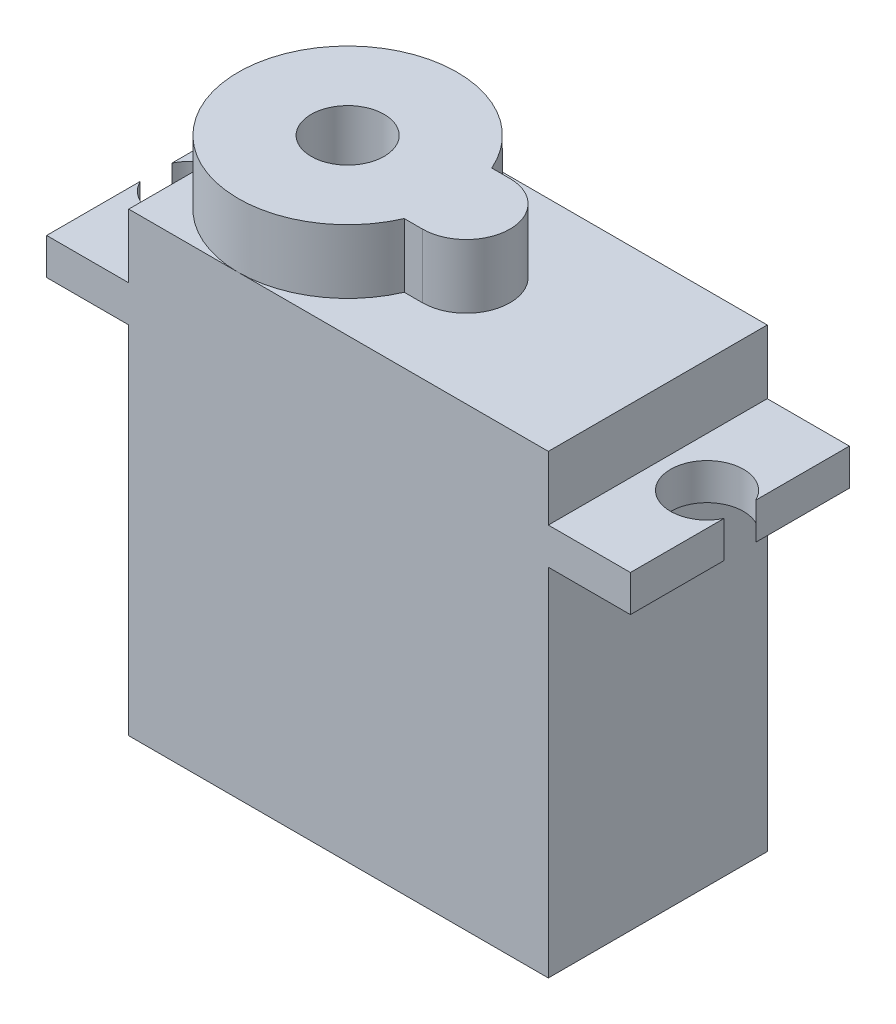
ISO-10303-21;
HEADER;
FILE_DESCRIPTION(('STEP AP214'),'2;1');
FILE_NAME('part.step','',(''),(''),'','','');
FILE_SCHEMA(('AUTOMOTIVE_DESIGN { 1 0 10303 214 1 1 1 1 }'));
ENDSEC;
DATA;
#1=APPLICATION_CONTEXT('core data for automotive mechanical design processes');
#2=APPLICATION_PROTOCOL_DEFINITION('international standard','automotive_design',2000,#1);
#3=PRODUCT_CONTEXT('',#1,'mechanical');
#4=PRODUCT('Part','Part','',(#3));
#5=PRODUCT_RELATED_PRODUCT_CATEGORY('part','',(#4));
#6=PRODUCT_DEFINITION_FORMATION('','',#4);
#7=PRODUCT_DEFINITION_CONTEXT('part definition',#1,'design');
#8=PRODUCT_DEFINITION('design','',#6,#7);
#9=PRODUCT_DEFINITION_SHAPE('','',#8);
#10=(LENGTH_UNIT() NAMED_UNIT(*) SI_UNIT(.MILLI.,.METRE.));
#11=(NAMED_UNIT(*) PLANE_ANGLE_UNIT() SI_UNIT($,.RADIAN.));
#12=(NAMED_UNIT(*) SI_UNIT($,.STERADIAN.) SOLID_ANGLE_UNIT());
#13=UNCERTAINTY_MEASURE_WITH_UNIT(LENGTH_MEASURE(1.E-05),#10,'distance_accuracy_value','');
#14=(GEOMETRIC_REPRESENTATION_CONTEXT(3) GLOBAL_UNCERTAINTY_ASSIGNED_CONTEXT((#13)) GLOBAL_UNIT_ASSIGNED_CONTEXT((#10,
#11,#12)) REPRESENTATION_CONTEXT('',''));
#15=CARTESIAN_POINT('',(0.,0.,0.));
#16=DIRECTION('',(0.,0.,1.));
#17=DIRECTION('',(1.,0.,0.));
#18=AXIS2_PLACEMENT_3D('',#15,#16,#17);
#19=CARTESIAN_POINT('',(0.,25.,0.));
#20=DIRECTION('',(0.,1.,0.));
#21=DIRECTION('',(0.,0.,1.));
#22=AXIS2_PLACEMENT_3D('',#19,#20,#21);
#23=PLANE('',#22);
#24=CARTESIAN_POINT('',(-5.5,25.,0.));
#25=DIRECTION('',(0.,1.,0.));
#26=DIRECTION('',(0.,0.,1.));
#27=AXIS2_PLACEMENT_3D('',#24,#25,#26);
#28=CIRCLE('',#27,6.);
#29=CARTESIAN_POINT('',(0.,25.,-2.39791576165636));
#30=VERTEX_POINT('',#29);
#31=CARTESIAN_POINT('',(-5.5,25.,-6.));
#32=VERTEX_POINT('',#31);
#33=EDGE_CURVE('E230',#30,#32,#28,.T.);
#34=ORIENTED_EDGE('',*,*,#33,.F.);
#35=DIRECTION('',(-1.,0.,0.));
#36=VECTOR('',#35,1.);
#37=CARTESIAN_POINT('',(0.,25.,-2.39791576165636));
#38=LINE('',#37,#36);
#39=CARTESIAN_POINT('',(1.,25.,-2.39791576165636));
#40=VERTEX_POINT('',#39);
#41=EDGE_CURVE('E212',#40,#30,#38,.T.);
#42=ORIENTED_EDGE('',*,*,#41,.F.);
#43=CARTESIAN_POINT('',(1.,25.,0.));
#44=DIRECTION('',(0.,1.,0.));
#45=DIRECTION('',(0.,0.,1.));
#46=AXIS2_PLACEMENT_3D('',#43,#44,#45);
#47=CIRCLE('',#46,2.39791576165636);
#48=CARTESIAN_POINT('',(1.,25.,2.39791576165636));
#49=VERTEX_POINT('',#48);
#50=EDGE_CURVE('E235',#49,#40,#47,.T.);
#51=ORIENTED_EDGE('',*,*,#50,.F.);
#52=DIRECTION('',(-1.,0.,0.));
#53=VECTOR('',#52,1.);
#54=CARTESIAN_POINT('',(0.,25.,2.39791576165636));
#55=LINE('',#54,#53);
#56=CARTESIAN_POINT('',(0.,25.,2.39791576165636));
#57=VERTEX_POINT('',#56);
#58=EDGE_CURVE('E232',#49,#57,#55,.T.);
#59=ORIENTED_EDGE('',*,*,#58,.T.);
#60=CARTESIAN_POINT('',(-5.5,25.,6.));
#61=VERTEX_POINT('',#60);
#62=EDGE_CURVE('E216',#61,#57,#28,.T.);
#63=ORIENTED_EDGE('',*,*,#62,.F.);
#64=DIRECTION('',(1.,0.,0.));
#65=VECTOR('',#64,1.);
#66=CARTESIAN_POINT('',(0.,25.,6.));
#67=LINE('',#66,#65);
#68=CARTESIAN_POINT('',(11.5,25.,6.));
#69=VERTEX_POINT('',#68);
#70=EDGE_CURVE('E323',#61,#69,#67,.T.);
#71=ORIENTED_EDGE('',*,*,#70,.T.);
#72=DIRECTION('',(0.,0.,-1.));
#73=VECTOR('',#72,1.);
#74=CARTESIAN_POINT('',(11.5,25.,0.));
#75=LINE('',#74,#73);
#76=CARTESIAN_POINT('',(11.5,25.,-6.));
#77=VERTEX_POINT('',#76);
#78=EDGE_CURVE('E328',#69,#77,#75,.T.);
#79=ORIENTED_EDGE('',*,*,#78,.T.);
#80=DIRECTION('',(1.,0.,0.));
#81=VECTOR('',#80,1.);
#82=CARTESIAN_POINT('',(0.,25.,-6.));
#83=LINE('',#82,#81);
#84=EDGE_CURVE('E331',#32,#77,#83,.T.);
#85=ORIENTED_EDGE('',*,*,#84,.F.);
#86=EDGE_LOOP('',(#34,#42,#51,#59,#63,#71,#79,#85));
#87=FACE_BOUND('',#86,.T.);
#88=ADVANCED_FACE('F55',(#87),#23,.T.);
#89=CARTESIAN_POINT('',(-11.5,25.,0.));
#90=VERTEX_POINT('',#89);
#91=EDGE_CURVE('E63',#32,#90,#28,.T.);
#92=ORIENTED_EDGE('',*,*,#91,.F.);
#93=CARTESIAN_POINT('',(-11.5,25.,-6.));
#94=VERTEX_POINT('',#93);
#95=EDGE_CURVE('E332',#94,#32,#83,.T.);
#96=ORIENTED_EDGE('',*,*,#95,.F.);
#97=DIRECTION('',(0.,0.,-1.));
#98=VECTOR('',#97,1.);
#99=CARTESIAN_POINT('',(-11.5,25.,0.));
#100=LINE('',#99,#98);
#101=EDGE_CURVE('E324',#90,#94,#100,.T.);
#102=ORIENTED_EDGE('',*,*,#101,.F.);
#103=EDGE_LOOP('',(#92,#96,#102));
#104=FACE_BOUND('',#103,.T.);
#105=ADVANCED_FACE('F397',(#104),#23,.T.);
#106=CARTESIAN_POINT('',(-11.5,25.,0.));
#107=DIRECTION('',(-1.,0.,0.));
#108=DIRECTION('',(0.,0.,1.));
#109=AXIS2_PLACEMENT_3D('',#106,#107,#108);
#110=PLANE('',#109);
#111=DIRECTION('',(0.,-1.,0.));
#112=VECTOR('',#111,1.);
#113=CARTESIAN_POINT('',(-11.5,25.,6.));
#114=LINE('',#113,#112);
#115=CARTESIAN_POINT('',(-11.5,19.5,6.));
#116=VERTEX_POINT('',#115);
#117=CARTESIAN_POINT('',(-11.5,0.,6.));
#118=VERTEX_POINT('',#117);
#119=EDGE_CURVE('E356',#116,#118,#114,.T.);
#120=ORIENTED_EDGE('',*,*,#119,.F.);
#121=DIRECTION('',(0.,0.,-1.));
#122=VECTOR('',#121,1.);
#123=CARTESIAN_POINT('',(-11.5,19.5,0.));
#124=LINE('',#123,#122);
#125=CARTESIAN_POINT('',(-11.5,19.5,-6.));
#126=VERTEX_POINT('',#125);
#127=EDGE_CURVE('E78',#116,#126,#124,.T.);
#128=ORIENTED_EDGE('',*,*,#127,.T.);
#129=DIRECTION('',(0.,-1.,0.));
#130=VECTOR('',#129,1.);
#131=CARTESIAN_POINT('',(-11.5,25.,-6.));
#132=LINE('',#131,#130);
#133=CARTESIAN_POINT('',(-11.5,0.,-6.));
#134=VERTEX_POINT('',#133);
#135=EDGE_CURVE('E335',#126,#134,#132,.T.);
#136=ORIENTED_EDGE('',*,*,#135,.T.);
#137=DIRECTION('',(0.,0.,-1.));
#138=VECTOR('',#137,1.);
#139=CARTESIAN_POINT('',(-11.5,0.,0.));
#140=LINE('',#139,#138);
#141=EDGE_CURVE('E319',#118,#134,#140,.T.);
#142=ORIENTED_EDGE('',*,*,#141,.F.);
#143=EDGE_LOOP('',(#120,#128,#136,#142));
#144=FACE_BOUND('',#143,.T.);
#145=ADVANCED_FACE('F372',(#144),#110,.T.);
#146=CARTESIAN_POINT('',(11.5,25.,0.));
#147=DIRECTION('',(-1.,0.,0.));
#148=DIRECTION('',(0.,0.,1.));
#149=AXIS2_PLACEMENT_3D('',#146,#147,#148);
#150=PLANE('',#149);
#151=DIRECTION('',(0.,0.,-1.));
#152=VECTOR('',#151,1.);
#153=CARTESIAN_POINT('',(11.5,19.5,0.));
#154=LINE('',#153,#152);
#155=CARTESIAN_POINT('',(11.5,19.5,6.));
#156=VERTEX_POINT('',#155);
#157=CARTESIAN_POINT('',(11.5,19.5,-6.));
#158=VERTEX_POINT('',#157);
#159=EDGE_CURVE('E305',#156,#158,#154,.T.);
#160=ORIENTED_EDGE('',*,*,#159,.F.);
#161=DIRECTION('',(0.,-1.,0.));
#162=VECTOR('',#161,1.);
#163=CARTESIAN_POINT('',(11.5,25.,6.));
#164=LINE('',#163,#162);
#165=CARTESIAN_POINT('',(11.5,0.,6.));
#166=VERTEX_POINT('',#165);
#167=EDGE_CURVE('E353',#156,#166,#164,.T.);
#168=ORIENTED_EDGE('',*,*,#167,.T.);
#169=DIRECTION('',(0.,0.,-1.));
#170=VECTOR('',#169,1.);
#171=CARTESIAN_POINT('',(11.5,0.,0.));
#172=LINE('',#171,#170);
#173=CARTESIAN_POINT('',(11.5,0.,-6.));
#174=VERTEX_POINT('',#173);
#175=EDGE_CURVE('E341',#166,#174,#172,.T.);
#176=ORIENTED_EDGE('',*,*,#175,.T.);
#177=DIRECTION('',(0.,-1.,0.));
#178=VECTOR('',#177,1.);
#179=CARTESIAN_POINT('',(11.5,25.,-6.));
#180=LINE('',#179,#178);
#181=EDGE_CURVE('E349',#158,#174,#180,.T.);
#182=ORIENTED_EDGE('',*,*,#181,.F.);
#183=EDGE_LOOP('',(#160,#168,#176,#182));
#184=FACE_BOUND('',#183,.T.);
#185=ADVANCED_FACE('F425',(#184),#150,.F.);
#186=DIRECTION('',(0.,0.,-1.));
#187=VECTOR('',#186,1.);
#188=CARTESIAN_POINT('',(-11.5,21.5,0.));
#189=LINE('',#188,#187);
#190=CARTESIAN_POINT('',(-11.5,21.5,6.));
#191=VERTEX_POINT('',#190);
#192=CARTESIAN_POINT('',(-11.5,21.5,-6.));
#193=VERTEX_POINT('',#192);
#194=EDGE_CURVE('E254',#191,#193,#189,.T.);
#195=ORIENTED_EDGE('',*,*,#194,.F.);
#196=CARTESIAN_POINT('',(-11.5,25.,6.));
#197=VERTEX_POINT('',#196);
#198=EDGE_CURVE('E357',#197,#191,#114,.T.);
#199=ORIENTED_EDGE('',*,*,#198,.F.);
#200=EDGE_CURVE('E320',#197,#90,#100,.T.);
#201=ORIENTED_EDGE('',*,*,#200,.T.);
#202=ORIENTED_EDGE('',*,*,#101,.T.);
#203=EDGE_CURVE('E347',#94,#193,#132,.T.);
#204=ORIENTED_EDGE('',*,*,#203,.T.);
#205=EDGE_LOOP('',(#195,#199,#201,#202,#204));
#206=FACE_BOUND('',#205,.T.);
#207=ADVANCED_FACE('F392',(#206),#110,.T.);
#208=CARTESIAN_POINT('',(0.,25.,6.));
#209=DIRECTION('',(0.,0.,-1.));
#210=DIRECTION('',(-1.,0.,0.));
#211=AXIS2_PLACEMENT_3D('',#208,#209,#210);
#212=PLANE('',#211);
#213=DIRECTION('',(1.,0.,0.));
#214=VECTOR('',#213,1.);
#215=CARTESIAN_POINT('',(0.,0.,6.));
#216=LINE('',#215,#214);
#217=EDGE_CURVE('E338',#118,#166,#216,.T.);
#218=ORIENTED_EDGE('',*,*,#217,.T.);
#219=ORIENTED_EDGE('',*,*,#167,.F.);
#220=DIRECTION('',(1.,0.,0.));
#221=VECTOR('',#220,1.);
#222=CARTESIAN_POINT('',(0.,19.5,6.));
#223=LINE('',#222,#221);
#224=CARTESIAN_POINT('',(16.,19.5,6.));
#225=VERTEX_POINT('',#224);
#226=EDGE_CURVE('E285',#156,#225,#223,.T.);
#227=ORIENTED_EDGE('',*,*,#226,.T.);
#228=DIRECTION('',(0.,-1.,0.));
#229=VECTOR('',#228,1.);
#230=CARTESIAN_POINT('',(16.,21.5,6.));
#231=LINE('',#230,#229);
#232=CARTESIAN_POINT('',(16.,21.5,6.));
#233=VERTEX_POINT('',#232);
#234=EDGE_CURVE('E296',#233,#225,#231,.T.);
#235=ORIENTED_EDGE('',*,*,#234,.F.);
#236=DIRECTION('',(1.,0.,0.));
#237=VECTOR('',#236,1.);
#238=CARTESIAN_POINT('',(0.,21.5,6.));
#239=LINE('',#238,#237);
#240=CARTESIAN_POINT('',(11.5,21.5,6.));
#241=VERTEX_POINT('',#240);
#242=EDGE_CURVE('E294',#241,#233,#239,.T.);
#243=ORIENTED_EDGE('',*,*,#242,.F.);
#244=EDGE_CURVE('E354',#69,#241,#164,.T.);
#245=ORIENTED_EDGE('',*,*,#244,.F.);
#246=ORIENTED_EDGE('',*,*,#70,.F.);
#247=EDGE_CURVE('E325',#197,#61,#67,.T.);
#248=ORIENTED_EDGE('',*,*,#247,.F.);
#249=ORIENTED_EDGE('',*,*,#198,.T.);
#250=DIRECTION('',(1.,0.,0.));
#251=VECTOR('',#250,1.);
#252=CARTESIAN_POINT('',(0.,21.5,6.));
#253=LINE('',#252,#251);
#254=CARTESIAN_POINT('',(-16.,21.5,6.));
#255=VERTEX_POINT('',#254);
#256=EDGE_CURVE('E250',#255,#191,#253,.T.);
#257=ORIENTED_EDGE('',*,*,#256,.F.);
#258=DIRECTION('',(0.,-1.,0.));
#259=VECTOR('',#258,1.);
#260=CARTESIAN_POINT('',(-16.,21.5,6.));
#261=LINE('',#260,#259);
#262=CARTESIAN_POINT('',(-16.,19.5,6.));
#263=VERTEX_POINT('',#262);
#264=EDGE_CURVE('E276',#255,#263,#261,.T.);
#265=ORIENTED_EDGE('',*,*,#264,.T.);
#266=DIRECTION('',(1.,0.,0.));
#267=VECTOR('',#266,1.);
#268=CARTESIAN_POINT('',(0.,19.5,6.));
#269=LINE('',#268,#267);
#270=EDGE_CURVE('E265',#263,#116,#269,.T.);
#271=ORIENTED_EDGE('',*,*,#270,.T.);
#272=ORIENTED_EDGE('',*,*,#119,.T.);
#273=EDGE_LOOP('',(#218,#219,#227,#235,#243,#245,#246,#248,#249,#257,#265,#271,#272));
#274=FACE_BOUND('',#273,.T.);
#275=ADVANCED_FACE('F364',(#274),#212,.F.);
#276=ORIENTED_EDGE('',*,*,#244,.T.);
#277=DIRECTION('',(0.,0.,-1.));
#278=VECTOR('',#277,1.);
#279=CARTESIAN_POINT('',(11.5,21.5,0.));
#280=LINE('',#279,#278);
#281=CARTESIAN_POINT('',(11.5,21.5,-6.));
#282=VERTEX_POINT('',#281);
#283=EDGE_CURVE('E291',#241,#282,#280,.T.);
#284=ORIENTED_EDGE('',*,*,#283,.T.);
#285=EDGE_CURVE('E350',#77,#282,#180,.T.);
#286=ORIENTED_EDGE('',*,*,#285,.F.);
#287=ORIENTED_EDGE('',*,*,#78,.F.);
#288=EDGE_LOOP('',(#276,#284,#286,#287));
#289=FACE_BOUND('',#288,.T.);
#290=ADVANCED_FACE('F406',(#289),#150,.F.);
#291=CARTESIAN_POINT('',(-5.5,25.,0.));
#292=DIRECTION('',(0.,-1.,0.));
#293=DIRECTION('',(0.,0.,-1.));
#294=AXIS2_PLACEMENT_3D('',#291,#292,#293);
#295=CYLINDRICAL_SURFACE('',#294,2.);
#296=CARTESIAN_POINT('',(-5.5,5.,0.));
#297=DIRECTION('',(0.,1.,0.));
#298=DIRECTION('',(0.,0.,1.));
#299=AXIS2_PLACEMENT_3D('',#296,#297,#298);
#300=CIRCLE('',#299,2.);
#301=CARTESIAN_POINT('',(-5.5,5.,2.));
#302=VERTEX_POINT('',#301);
#303=EDGE_CURVE('E12',#302,#302,#300,.T.);
#304=ORIENTED_EDGE('',*,*,#303,.F.);
#305=EDGE_LOOP('',(#304));
#306=FACE_BOUND('',#305,.T.);
#307=CARTESIAN_POINT('',(-5.5,28.5,0.));
#308=DIRECTION('',(0.,1.,0.));
#309=DIRECTION('',(0.,0.,1.));
#310=AXIS2_PLACEMENT_3D('',#307,#308,#309);
#311=CIRCLE('',#310,2.);
#312=CARTESIAN_POINT('',(-5.5,28.5,2.));
#313=VERTEX_POINT('',#312);
#314=EDGE_CURVE('E233',#313,#313,#311,.T.);
#315=ORIENTED_EDGE('',*,*,#314,.T.);
#316=EDGE_LOOP('',(#315));
#317=FACE_BOUND('',#316,.T.);
#318=ADVANCED_FACE('F57',(#306,#317),#295,.F.);
#319=CARTESIAN_POINT('',(0.,25.,-6.));
#320=DIRECTION('',(0.,0.,-1.));
#321=DIRECTION('',(-1.,0.,0.));
#322=AXIS2_PLACEMENT_3D('',#319,#320,#321);
#323=PLANE('',#322);
#324=DIRECTION('',(1.,0.,0.));
#325=VECTOR('',#324,1.);
#326=CARTESIAN_POINT('',(0.,0.,-6.));
#327=LINE('',#326,#325);
#328=EDGE_CURVE('E344',#134,#174,#327,.T.);
#329=ORIENTED_EDGE('',*,*,#328,.F.);
#330=ORIENTED_EDGE('',*,*,#135,.F.);
#331=DIRECTION('',(1.,0.,0.));
#332=VECTOR('',#331,1.);
#333=CARTESIAN_POINT('',(0.,19.5,-6.));
#334=LINE('',#333,#332);
#335=CARTESIAN_POINT('',(-16.,19.5,-6.));
#336=VERTEX_POINT('',#335);
#337=EDGE_CURVE('E269',#336,#126,#334,.T.);
#338=ORIENTED_EDGE('',*,*,#337,.F.);
#339=DIRECTION('',(0.,-1.,0.));
#340=VECTOR('',#339,1.);
#341=CARTESIAN_POINT('',(-16.,21.5,-6.));
#342=LINE('',#341,#340);
#343=CARTESIAN_POINT('',(-16.,21.5,-6.));
#344=VERTEX_POINT('',#343);
#345=EDGE_CURVE('E274',#344,#336,#342,.T.);
#346=ORIENTED_EDGE('',*,*,#345,.F.);
#347=DIRECTION('',(1.,0.,0.));
#348=VECTOR('',#347,1.);
#349=CARTESIAN_POINT('',(0.,21.5,-6.));
#350=LINE('',#349,#348);
#351=EDGE_CURVE('E257',#344,#193,#350,.T.);
#352=ORIENTED_EDGE('',*,*,#351,.T.);
#353=ORIENTED_EDGE('',*,*,#203,.F.);
#354=ORIENTED_EDGE('',*,*,#95,.T.);
#355=ORIENTED_EDGE('',*,*,#84,.T.);
#356=ORIENTED_EDGE('',*,*,#285,.T.);
#357=DIRECTION('',(1.,0.,0.));
#358=VECTOR('',#357,1.);
#359=CARTESIAN_POINT('',(0.,21.5,-6.));
#360=LINE('',#359,#358);
#361=CARTESIAN_POINT('',(16.,21.5,-6.));
#362=VERTEX_POINT('',#361);
#363=EDGE_CURVE('E288',#282,#362,#360,.T.);
#364=ORIENTED_EDGE('',*,*,#363,.T.);
#365=DIRECTION('',(0.,-1.,0.));
#366=VECTOR('',#365,1.);
#367=CARTESIAN_POINT('',(16.,21.5,-6.));
#368=LINE('',#367,#366);
#369=CARTESIAN_POINT('',(16.,19.5,-6.));
#370=VERTEX_POINT('',#369);
#371=EDGE_CURVE('E311',#362,#370,#368,.T.);
#372=ORIENTED_EDGE('',*,*,#371,.T.);
#373=DIRECTION('',(1.,0.,0.));
#374=VECTOR('',#373,1.);
#375=CARTESIAN_POINT('',(0.,19.5,-6.));
#376=LINE('',#375,#374);
#377=EDGE_CURVE('E302',#158,#370,#376,.T.);
#378=ORIENTED_EDGE('',*,*,#377,.F.);
#379=ORIENTED_EDGE('',*,*,#181,.T.);
#380=EDGE_LOOP('',(#329,#330,#338,#346,#352,#353,#354,#355,#356,#364,#372,#378,#379));
#381=FACE_BOUND('',#380,.T.);
#382=ADVANCED_FACE('F375',(#381),#323,.T.);
#383=EDGE_CURVE('E362',#90,#61,#28,.T.);
#384=ORIENTED_EDGE('',*,*,#383,.F.);
#385=ORIENTED_EDGE('',*,*,#200,.F.);
#386=ORIENTED_EDGE('',*,*,#247,.T.);
#387=EDGE_LOOP('',(#384,#385,#386));
#388=FACE_BOUND('',#387,.T.);
#389=ADVANCED_FACE('F441',(#388),#23,.T.);
#390=CARTESIAN_POINT('',(0.,0.,0.));
#391=DIRECTION('',(0.,1.,0.));
#392=DIRECTION('',(0.,0.,1.));
#393=AXIS2_PLACEMENT_3D('',#390,#391,#392);
#394=PLANE('',#393);
#395=ORIENTED_EDGE('',*,*,#141,.T.);
#396=ORIENTED_EDGE('',*,*,#328,.T.);
#397=ORIENTED_EDGE('',*,*,#175,.F.);
#398=ORIENTED_EDGE('',*,*,#217,.F.);
#399=EDGE_LOOP('',(#395,#396,#397,#398));
#400=FACE_BOUND('',#399,.T.);
#401=ADVANCED_FACE('F370',(#400),#394,.F.);
#402=CARTESIAN_POINT('',(16.,21.5,0.));
#403=DIRECTION('',(-1.,0.,0.));
#404=DIRECTION('',(0.,0.,1.));
#405=AXIS2_PLACEMENT_3D('',#402,#403,#404);
#406=PLANE('',#405);
#407=DIRECTION('',(0.,0.,-1.));
#408=VECTOR('',#407,1.);
#409=CARTESIAN_POINT('',(16.,19.5,0.));
#410=LINE('',#409,#408);
#411=CARTESIAN_POINT('',(16.,19.5,0.871779788708135));
#412=VERTEX_POINT('',#411);
#413=EDGE_CURVE('E280',#225,#412,#410,.T.);
#414=ORIENTED_EDGE('',*,*,#413,.T.);
#415=DIRECTION('',(0.,-1.,0.));
#416=VECTOR('',#415,1.);
#417=CARTESIAN_POINT('',(16.,21.5,0.871779788708135));
#418=LINE('',#417,#416);
#419=CARTESIAN_POINT('',(16.,21.5,0.871779788708135));
#420=VERTEX_POINT('',#419);
#421=EDGE_CURVE('E316',#420,#412,#418,.T.);
#422=ORIENTED_EDGE('',*,*,#421,.F.);
#423=DIRECTION('',(0.,0.,-1.));
#424=VECTOR('',#423,1.);
#425=CARTESIAN_POINT('',(16.,21.5,0.));
#426=LINE('',#425,#424);
#427=EDGE_CURVE('E281',#233,#420,#426,.T.);
#428=ORIENTED_EDGE('',*,*,#427,.F.);
#429=ORIENTED_EDGE('',*,*,#234,.T.);
#430=EDGE_LOOP('',(#414,#422,#428,#429));
#431=FACE_BOUND('',#430,.T.);
#432=ADVANCED_FACE('F428',(#431),#406,.F.);
#433=CARTESIAN_POINT('',(14.2,21.5,0.));
#434=DIRECTION('',(0.,-1.,0.));
#435=DIRECTION('',(0.,0.,-1.));
#436=AXIS2_PLACEMENT_3D('',#433,#434,#435);
#437=CYLINDRICAL_SURFACE('',#436,2.);
#438=CARTESIAN_POINT('',(14.2,19.5,0.));
#439=DIRECTION('',(0.,1.,0.));
#440=DIRECTION('',(0.,0.,1.));
#441=AXIS2_PLACEMENT_3D('',#438,#439,#440);
#442=CIRCLE('',#441,2.);
#443=CARTESIAN_POINT('',(16.,19.5,-0.871779788708135));
#444=VERTEX_POINT('',#443);
#445=EDGE_CURVE('E299',#412,#444,#442,.F.);
#446=ORIENTED_EDGE('',*,*,#445,.T.);
#447=DIRECTION('',(0.,-1.,0.));
#448=VECTOR('',#447,1.);
#449=CARTESIAN_POINT('',(16.,21.5,-0.871779788708135));
#450=LINE('',#449,#448);
#451=CARTESIAN_POINT('',(16.,21.5,-0.871779788708135));
#452=VERTEX_POINT('',#451);
#453=EDGE_CURVE('E313',#452,#444,#450,.T.);
#454=ORIENTED_EDGE('',*,*,#453,.F.);
#455=CARTESIAN_POINT('',(14.2,21.5,0.));
#456=DIRECTION('',(0.,1.,0.));
#457=DIRECTION('',(0.,0.,1.));
#458=AXIS2_PLACEMENT_3D('',#455,#456,#457);
#459=CIRCLE('',#458,2.);
#460=EDGE_CURVE('E284',#420,#452,#459,.F.);
#461=ORIENTED_EDGE('',*,*,#460,.F.);
#462=ORIENTED_EDGE('',*,*,#421,.T.);
#463=EDGE_LOOP('',(#446,#454,#461,#462));
#464=FACE_BOUND('',#463,.T.);
#465=ADVANCED_FACE('F431',(#464),#437,.F.);
#466=EDGE_CURVE('E300',#444,#370,#410,.T.);
#467=ORIENTED_EDGE('',*,*,#466,.T.);
#468=ORIENTED_EDGE('',*,*,#371,.F.);
#469=EDGE_CURVE('E286',#452,#362,#426,.T.);
#470=ORIENTED_EDGE('',*,*,#469,.F.);
#471=ORIENTED_EDGE('',*,*,#453,.T.);
#472=EDGE_LOOP('',(#467,#468,#470,#471));
#473=FACE_BOUND('',#472,.T.);
#474=ADVANCED_FACE('F417',(#473),#406,.F.);
#475=CARTESIAN_POINT('',(0.,21.5,0.));
#476=DIRECTION('',(0.,1.,0.));
#477=DIRECTION('',(0.,0.,1.));
#478=AXIS2_PLACEMENT_3D('',#475,#476,#477);
#479=PLANE('',#478);
#480=ORIENTED_EDGE('',*,*,#427,.T.);
#481=ORIENTED_EDGE('',*,*,#460,.T.);
#482=ORIENTED_EDGE('',*,*,#469,.T.);
#483=ORIENTED_EDGE('',*,*,#363,.F.);
#484=ORIENTED_EDGE('',*,*,#283,.F.);
#485=ORIENTED_EDGE('',*,*,#242,.T.);
#486=EDGE_LOOP('',(#480,#481,#482,#483,#484,#485));
#487=FACE_BOUND('',#486,.T.);
#488=ADVANCED_FACE('F410',(#487),#479,.T.);
#489=CARTESIAN_POINT('',(0.,19.5,0.));
#490=DIRECTION('',(0.,1.,0.));
#491=DIRECTION('',(0.,0.,1.));
#492=AXIS2_PLACEMENT_3D('',#489,#490,#491);
#493=PLANE('',#492);
#494=ORIENTED_EDGE('',*,*,#413,.F.);
#495=ORIENTED_EDGE('',*,*,#226,.F.);
#496=ORIENTED_EDGE('',*,*,#159,.T.);
#497=ORIENTED_EDGE('',*,*,#377,.T.);
#498=ORIENTED_EDGE('',*,*,#466,.F.);
#499=ORIENTED_EDGE('',*,*,#445,.F.);
#500=EDGE_LOOP('',(#494,#495,#496,#497,#498,#499));
#501=FACE_BOUND('',#500,.T.);
#502=ADVANCED_FACE('F423',(#501),#493,.F.);
#503=CARTESIAN_POINT('',(-14.2,21.5,0.));
#504=DIRECTION('',(0.,-1.,0.));
#505=DIRECTION('',(0.,0.,-1.));
#506=AXIS2_PLACEMENT_3D('',#503,#504,#505);
#507=CYLINDRICAL_SURFACE('',#506,2.);
#508=CARTESIAN_POINT('',(-14.2,19.5,0.));
#509=DIRECTION('',(0.,1.,0.));
#510=DIRECTION('',(0.,0.,1.));
#511=AXIS2_PLACEMENT_3D('',#508,#509,#510);
#512=CIRCLE('',#511,2.);
#513=CARTESIAN_POINT('',(-16.,19.5,0.871779788708135));
#514=VERTEX_POINT('',#513);
#515=CARTESIAN_POINT('',(-16.,19.5,-0.871779788708135));
#516=VERTEX_POINT('',#515);
#517=EDGE_CURVE('E218',#514,#516,#512,.T.);
#518=ORIENTED_EDGE('',*,*,#517,.F.);
#519=DIRECTION('',(0.,-1.,0.));
#520=VECTOR('',#519,1.);
#521=CARTESIAN_POINT('',(-16.,21.5,0.871779788708135));
#522=LINE('',#521,#520);
#523=CARTESIAN_POINT('',(-16.,21.5,0.871779788708135));
#524=VERTEX_POINT('',#523);
#525=EDGE_CURVE('E278',#524,#514,#522,.T.);
#526=ORIENTED_EDGE('',*,*,#525,.F.);
#527=CARTESIAN_POINT('',(-14.2,21.5,0.));
#528=DIRECTION('',(0.,1.,0.));
#529=DIRECTION('',(0.,0.,1.));
#530=AXIS2_PLACEMENT_3D('',#527,#528,#529);
#531=CIRCLE('',#530,2.);
#532=CARTESIAN_POINT('',(-16.,21.5,-0.871779788708135));
#533=VERTEX_POINT('',#532);
#534=EDGE_CURVE('E243',#524,#533,#531,.T.);
#535=ORIENTED_EDGE('',*,*,#534,.T.);
#536=DIRECTION('',(0.,-1.,0.));
#537=VECTOR('',#536,1.);
#538=CARTESIAN_POINT('',(-16.,21.5,-0.871779788708135));
#539=LINE('',#538,#537);
#540=EDGE_CURVE('E272',#533,#516,#539,.T.);
#541=ORIENTED_EDGE('',*,*,#540,.T.);
#542=EDGE_LOOP('',(#518,#526,#535,#541));
#543=FACE_BOUND('',#542,.T.);
#544=ADVANCED_FACE('F484',(#543),#507,.F.);
#545=CARTESIAN_POINT('',(-16.,21.5,0.));
#546=DIRECTION('',(-1.,0.,0.));
#547=DIRECTION('',(0.,0.,1.));
#548=AXIS2_PLACEMENT_3D('',#545,#546,#547);
#549=PLANE('',#548);
#550=DIRECTION('',(0.,0.,-1.));
#551=VECTOR('',#550,1.);
#552=CARTESIAN_POINT('',(-16.,19.5,0.));
#553=LINE('',#552,#551);
#554=EDGE_CURVE('E262',#263,#514,#553,.T.);
#555=ORIENTED_EDGE('',*,*,#554,.F.);
#556=ORIENTED_EDGE('',*,*,#264,.F.);
#557=DIRECTION('',(0.,0.,-1.));
#558=VECTOR('',#557,1.);
#559=CARTESIAN_POINT('',(-16.,21.5,0.));
#560=LINE('',#559,#558);
#561=EDGE_CURVE('E246',#255,#524,#560,.T.);
#562=ORIENTED_EDGE('',*,*,#561,.T.);
#563=ORIENTED_EDGE('',*,*,#525,.T.);
#564=EDGE_LOOP('',(#555,#556,#562,#563));
#565=FACE_BOUND('',#564,.T.);
#566=ADVANCED_FACE('F483',(#565),#549,.T.);
#567=EDGE_CURVE('E247',#516,#336,#553,.T.);
#568=ORIENTED_EDGE('',*,*,#567,.F.);
#569=ORIENTED_EDGE('',*,*,#540,.F.);
#570=EDGE_CURVE('E251',#533,#344,#560,.T.);
#571=ORIENTED_EDGE('',*,*,#570,.T.);
#572=ORIENTED_EDGE('',*,*,#345,.T.);
#573=EDGE_LOOP('',(#568,#569,#571,#572));
#574=FACE_BOUND('',#573,.T.);
#575=ADVANCED_FACE('F382',(#574),#549,.T.);
#576=CARTESIAN_POINT('',(0.,21.5,0.));
#577=DIRECTION('',(0.,1.,0.));
#578=DIRECTION('',(0.,0.,1.));
#579=AXIS2_PLACEMENT_3D('',#576,#577,#578);
#580=PLANE('',#579);
#581=ORIENTED_EDGE('',*,*,#534,.F.);
#582=ORIENTED_EDGE('',*,*,#561,.F.);
#583=ORIENTED_EDGE('',*,*,#256,.T.);
#584=ORIENTED_EDGE('',*,*,#194,.T.);
#585=ORIENTED_EDGE('',*,*,#351,.F.);
#586=ORIENTED_EDGE('',*,*,#570,.F.);
#587=EDGE_LOOP('',(#581,#582,#583,#584,#585,#586));
#588=FACE_BOUND('',#587,.T.);
#589=ADVANCED_FACE('F389',(#588),#580,.T.);
#590=CARTESIAN_POINT('',(0.,19.5,0.));
#591=DIRECTION('',(0.,1.,0.));
#592=DIRECTION('',(0.,0.,1.));
#593=AXIS2_PLACEMENT_3D('',#590,#591,#592);
#594=PLANE('',#593);
#595=ORIENTED_EDGE('',*,*,#517,.T.);
#596=ORIENTED_EDGE('',*,*,#567,.T.);
#597=ORIENTED_EDGE('',*,*,#337,.T.);
#598=ORIENTED_EDGE('',*,*,#127,.F.);
#599=ORIENTED_EDGE('',*,*,#270,.F.);
#600=ORIENTED_EDGE('',*,*,#554,.T.);
#601=EDGE_LOOP('',(#595,#596,#597,#598,#599,#600));
#602=FACE_BOUND('',#601,.T.);
#603=ADVANCED_FACE('F378',(#602),#594,.F.);
#604=CARTESIAN_POINT('',(-5.5,28.5,0.));
#605=DIRECTION('',(0.,1.,0.));
#606=DIRECTION('',(0.,0.,1.));
#607=AXIS2_PLACEMENT_3D('',#604,#605,#606);
#608=PLANE('',#607);
#609=CARTESIAN_POINT('',(-5.5,28.5,0.));
#610=DIRECTION('',(0.,1.,0.));
#611=DIRECTION('',(0.,0.,1.));
#612=AXIS2_PLACEMENT_3D('',#609,#610,#611);
#613=CIRCLE('',#612,6.);
#614=CARTESIAN_POINT('',(0.,28.5,-2.39791576165636));
#615=VERTEX_POINT('',#614);
#616=CARTESIAN_POINT('',(0.,28.5,2.39791576165636));
#617=VERTEX_POINT('',#616);
#618=EDGE_CURVE('E203',#615,#617,#613,.T.);
#619=ORIENTED_EDGE('',*,*,#618,.T.);
#620=DIRECTION('',(-1.,0.,0.));
#621=VECTOR('',#620,1.);
#622=CARTESIAN_POINT('',(0.,28.5,2.39791576165636));
#623=LINE('',#622,#621);
#624=CARTESIAN_POINT('',(1.,28.5,2.39791576165636));
#625=VERTEX_POINT('',#624);
#626=EDGE_CURVE('E206',#625,#617,#623,.T.);
#627=ORIENTED_EDGE('',*,*,#626,.F.);
#628=CARTESIAN_POINT('',(1.,28.5,0.));
#629=DIRECTION('',(0.,1.,0.));
#630=DIRECTION('',(0.,0.,1.));
#631=AXIS2_PLACEMENT_3D('',#628,#629,#630);
#632=CIRCLE('',#631,2.39791576165636);
#633=CARTESIAN_POINT('',(1.,28.5,-2.39791576165636));
#634=VERTEX_POINT('',#633);
#635=EDGE_CURVE('E223',#625,#634,#632,.T.);
#636=ORIENTED_EDGE('',*,*,#635,.T.);
#637=DIRECTION('',(-1.,0.,0.));
#638=VECTOR('',#637,1.);
#639=CARTESIAN_POINT('',(0.,28.5,-2.39791576165636));
#640=LINE('',#639,#638);
#641=EDGE_CURVE('E208',#634,#615,#640,.T.);
#642=ORIENTED_EDGE('',*,*,#641,.T.);
#643=EDGE_LOOP('',(#619,#627,#636,#642));
#644=FACE_BOUND('',#643,.T.);
#645=ORIENTED_EDGE('',*,*,#314,.F.);
#646=EDGE_LOOP('',(#645));
#647=FACE_BOUND('',#646,.T.);
#648=ADVANCED_FACE('F204',(#644,#647),#608,.T.);
#649=CARTESIAN_POINT('',(-5.5,28.5,0.));
#650=DIRECTION('',(0.,-1.,0.));
#651=DIRECTION('',(0.,0.,-1.));
#652=AXIS2_PLACEMENT_3D('',#649,#650,#651);
#653=CYLINDRICAL_SURFACE('',#652,6.);
#654=ORIENTED_EDGE('',*,*,#33,.T.);
#655=ORIENTED_EDGE('',*,*,#91,.T.);
#656=ORIENTED_EDGE('',*,*,#383,.T.);
#657=ORIENTED_EDGE('',*,*,#62,.T.);
#658=DIRECTION('',(0.,-1.,0.));
#659=VECTOR('',#658,1.);
#660=CARTESIAN_POINT('',(0.,28.5,2.39791576165636));
#661=LINE('',#660,#659);
#662=EDGE_CURVE('E70',#617,#57,#661,.T.);
#663=ORIENTED_EDGE('',*,*,#662,.F.);
#664=ORIENTED_EDGE('',*,*,#618,.F.);
#665=DIRECTION('',(0.,-1.,0.));
#666=VECTOR('',#665,1.);
#667=CARTESIAN_POINT('',(0.,28.5,-2.39791576165636));
#668=LINE('',#667,#666);
#669=EDGE_CURVE('E229',#615,#30,#668,.T.);
#670=ORIENTED_EDGE('',*,*,#669,.T.);
#671=EDGE_LOOP('',(#654,#655,#656,#657,#663,#664,#670));
#672=FACE_BOUND('',#671,.T.);
#673=ADVANCED_FACE('F214',(#672),#653,.T.);
#674=CARTESIAN_POINT('',(0.,28.5,2.39791576165636));
#675=DIRECTION('',(0.,0.,1.));
#676=DIRECTION('',(1.,0.,0.));
#677=AXIS2_PLACEMENT_3D('',#674,#675,#676);
#678=PLANE('',#677);
#679=ORIENTED_EDGE('',*,*,#58,.F.);
#680=DIRECTION('',(0.,-1.,0.));
#681=VECTOR('',#680,1.);
#682=CARTESIAN_POINT('',(1.,28.5,2.39791576165636));
#683=LINE('',#682,#681);
#684=EDGE_CURVE('E219',#625,#49,#683,.T.);
#685=ORIENTED_EDGE('',*,*,#684,.F.);
#686=ORIENTED_EDGE('',*,*,#626,.T.);
#687=ORIENTED_EDGE('',*,*,#662,.T.);
#688=EDGE_LOOP('',(#679,#685,#686,#687));
#689=FACE_BOUND('',#688,.T.);
#690=ADVANCED_FACE('F221',(#689),#678,.T.);
#691=CARTESIAN_POINT('',(1.,28.5,0.));
#692=DIRECTION('',(0.,-1.,0.));
#693=DIRECTION('',(0.,0.,-1.));
#694=AXIS2_PLACEMENT_3D('',#691,#692,#693);
#695=CYLINDRICAL_SURFACE('',#694,2.39791576165636);
#696=ORIENTED_EDGE('',*,*,#50,.T.);
#697=DIRECTION('',(0.,-1.,0.));
#698=VECTOR('',#697,1.);
#699=CARTESIAN_POINT('',(1.,28.5,-2.39791576165636));
#700=LINE('',#699,#698);
#701=EDGE_CURVE('E239',#634,#40,#700,.T.);
#702=ORIENTED_EDGE('',*,*,#701,.F.);
#703=ORIENTED_EDGE('',*,*,#635,.F.);
#704=ORIENTED_EDGE('',*,*,#684,.T.);
#705=EDGE_LOOP('',(#696,#702,#703,#704));
#706=FACE_BOUND('',#705,.T.);
#707=ADVANCED_FACE('F458',(#706),#695,.T.);
#708=CARTESIAN_POINT('',(0.,28.5,-2.39791576165636));
#709=DIRECTION('',(0.,0.,1.));
#710=DIRECTION('',(1.,0.,0.));
#711=AXIS2_PLACEMENT_3D('',#708,#709,#710);
#712=PLANE('',#711);
#713=ORIENTED_EDGE('',*,*,#41,.T.);
#714=ORIENTED_EDGE('',*,*,#669,.F.);
#715=ORIENTED_EDGE('',*,*,#641,.F.);
#716=ORIENTED_EDGE('',*,*,#701,.T.);
#717=EDGE_LOOP('',(#713,#714,#715,#716));
#718=FACE_BOUND('',#717,.T.);
#719=ADVANCED_FACE('F460',(#718),#712,.F.);
#720=CARTESIAN_POINT('',(-5.5,5.,0.));
#721=DIRECTION('',(0.,1.,0.));
#722=DIRECTION('',(0.,0.,1.));
#723=AXIS2_PLACEMENT_3D('',#720,#721,#722);
#724=PLANE('',#723);
#725=ORIENTED_EDGE('',*,*,#303,.T.);
#726=EDGE_LOOP('',(#725));
#727=FACE_BOUND('',#726,.T.);
#728=ADVANCED_FACE('F462',(#727),#724,.T.);
#729=CLOSED_SHELL('',(#88,#105,#145,#185,#207,#275,#290,#318,#382,#389,#401,#432,#465,#474,#488,
#502,#544,#566,#575,#589,#603,#648,#673,#690,#707,#719,#728));
#730=MANIFOLD_SOLID_BREP('B2',#729);
#731=ADVANCED_BREP_SHAPE_REPRESENTATION('',(#18,#730),#14);
#732=SHAPE_DEFINITION_REPRESENTATION(#9,#731);
ENDSEC;
END-ISO-10303-21;
